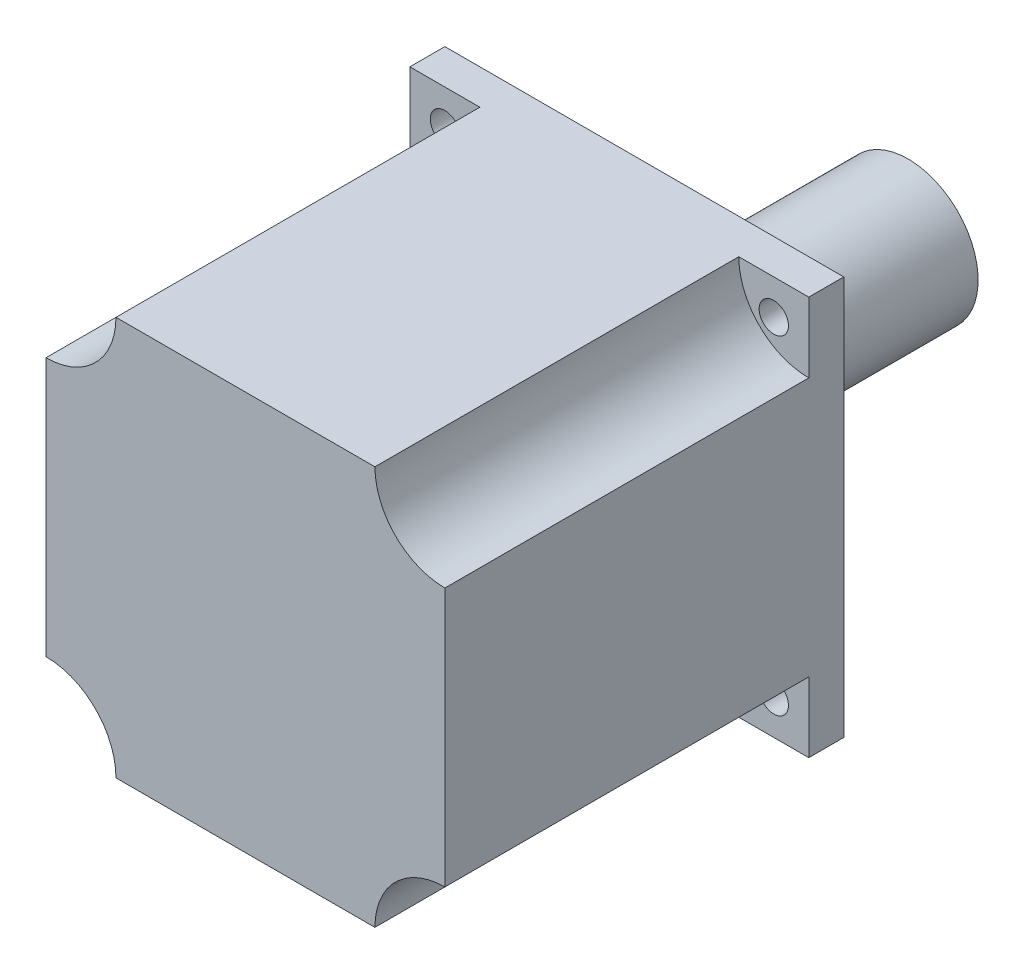
ISO-10303-21;
HEADER;
FILE_DESCRIPTION(('STEP AP214'),'2;1');
FILE_NAME('part.step','',(''),(''),'','','');
FILE_SCHEMA(('AUTOMOTIVE_DESIGN { 1 0 10303 214 1 1 1 1 }'));
ENDSEC;
DATA;
#1=APPLICATION_CONTEXT('core data for automotive mechanical design processes');
#2=APPLICATION_PROTOCOL_DEFINITION('international standard','automotive_design',2000,#1);
#3=PRODUCT_CONTEXT('',#1,'mechanical');
#4=PRODUCT('Part','Part','',(#3));
#5=PRODUCT_RELATED_PRODUCT_CATEGORY('part','',(#4));
#6=PRODUCT_DEFINITION_FORMATION('','',#4);
#7=PRODUCT_DEFINITION_CONTEXT('part definition',#1,'design');
#8=PRODUCT_DEFINITION('design','',#6,#7);
#9=PRODUCT_DEFINITION_SHAPE('','',#8);
#10=(LENGTH_UNIT() NAMED_UNIT(*) SI_UNIT(.MILLI.,.METRE.));
#11=(NAMED_UNIT(*) PLANE_ANGLE_UNIT() SI_UNIT($,.RADIAN.));
#12=(NAMED_UNIT(*) SI_UNIT($,.STERADIAN.) SOLID_ANGLE_UNIT());
#13=UNCERTAINTY_MEASURE_WITH_UNIT(LENGTH_MEASURE(1.E-05),#10,'distance_accuracy_value','');
#14=(GEOMETRIC_REPRESENTATION_CONTEXT(3) GLOBAL_UNCERTAINTY_ASSIGNED_CONTEXT((#13)) GLOBAL_UNIT_ASSIGNED_CONTEXT((#10,
#11,#12)) REPRESENTATION_CONTEXT('',''));
#15=CARTESIAN_POINT('',(0.,0.,0.));
#16=DIRECTION('',(0.,0.,1.));
#17=DIRECTION('',(1.,0.,0.));
#18=AXIS2_PLACEMENT_3D('',#15,#16,#17);
#19=CARTESIAN_POINT('',(28.5,-28.5,57.));
#20=DIRECTION('',(-1.,0.,0.));
#21=DIRECTION('',(0.,0.,1.));
#22=AXIS2_PLACEMENT_3D('',#19,#20,#21);
#23=PLANE('',#22);
#24=DIRECTION('',(0.,1.,0.));
#25=VECTOR('',#24,1.);
#26=CARTESIAN_POINT('',(28.5,-28.5,57.));
#27=LINE('',#26,#25);
#28=CARTESIAN_POINT('',(28.5,-18.5,57.));
#29=VERTEX_POINT('',#28);
#30=CARTESIAN_POINT('',(28.5,18.5,57.));
#31=VERTEX_POINT('',#30);
#32=EDGE_CURVE('E199',#29,#31,#27,.T.);
#33=ORIENTED_EDGE('',*,*,#32,.F.);
#34=DIRECTION('',(0.,0.,1.));
#35=VECTOR('',#34,1.);
#36=CARTESIAN_POINT('',(28.5,-18.5,5.));
#37=LINE('',#36,#35);
#38=CARTESIAN_POINT('',(28.5,-18.5,5.));
#39=VERTEX_POINT('',#38);
#40=EDGE_CURVE('E178',#29,#39,#37,.F.);
#41=ORIENTED_EDGE('',*,*,#40,.T.);
#42=DIRECTION('',(0.,1.,0.));
#43=VECTOR('',#42,1.);
#44=CARTESIAN_POINT('',(28.5,-28.5,5.));
#45=LINE('',#44,#43);
#46=CARTESIAN_POINT('',(28.5,-28.5,5.));
#47=VERTEX_POINT('',#46);
#48=EDGE_CURVE('E190',#47,#39,#45,.T.);
#49=ORIENTED_EDGE('',*,*,#48,.F.);
#50=DIRECTION('',(0.,0.,-1.));
#51=VECTOR('',#50,1.);
#52=CARTESIAN_POINT('',(28.5,-28.5,57.));
#53=LINE('',#52,#51);
#54=CARTESIAN_POINT('',(28.5,-28.5,0.));
#55=VERTEX_POINT('',#54);
#56=EDGE_CURVE('E214',#47,#55,#53,.T.);
#57=ORIENTED_EDGE('',*,*,#56,.T.);
#58=DIRECTION('',(0.,1.,0.));
#59=VECTOR('',#58,1.);
#60=CARTESIAN_POINT('',(28.5,-28.5,0.));
#61=LINE('',#60,#59);
#62=CARTESIAN_POINT('',(28.5,28.5,0.));
#63=VERTEX_POINT('',#62);
#64=EDGE_CURVE('E198',#55,#63,#61,.T.);
#65=ORIENTED_EDGE('',*,*,#64,.T.);
#66=DIRECTION('',(0.,0.,-1.));
#67=VECTOR('',#66,1.);
#68=CARTESIAN_POINT('',(28.5,28.5,57.));
#69=LINE('',#68,#67);
#70=CARTESIAN_POINT('',(28.5,28.5,5.));
#71=VERTEX_POINT('',#70);
#72=EDGE_CURVE('E237',#71,#63,#69,.T.);
#73=ORIENTED_EDGE('',*,*,#72,.F.);
#74=DIRECTION('',(0.,1.,0.));
#75=VECTOR('',#74,1.);
#76=CARTESIAN_POINT('',(28.5,-28.5,5.));
#77=LINE('',#76,#75);
#78=CARTESIAN_POINT('',(28.5,18.5,5.));
#79=VERTEX_POINT('',#78);
#80=EDGE_CURVE('E143',#79,#71,#77,.T.);
#81=ORIENTED_EDGE('',*,*,#80,.F.);
#82=DIRECTION('',(0.,0.,1.));
#83=VECTOR('',#82,1.);
#84=CARTESIAN_POINT('',(28.5,18.5,5.));
#85=LINE('',#84,#83);
#86=EDGE_CURVE('E152',#79,#31,#85,.T.);
#87=ORIENTED_EDGE('',*,*,#86,.T.);
#88=EDGE_LOOP('',(#33,#41,#49,#57,#65,#73,#81,#87));
#89=FACE_BOUND('',#88,.T.);
#90=ADVANCED_FACE('F49',(#89),#23,.F.);
#91=CARTESIAN_POINT('',(-28.5,28.5,57.));
#92=DIRECTION('',(0.,-1.,0.));
#93=DIRECTION('',(0.,0.,-1.));
#94=AXIS2_PLACEMENT_3D('',#91,#92,#93);
#95=PLANE('',#94);
#96=DIRECTION('',(-1.,0.,0.));
#97=VECTOR('',#96,1.);
#98=CARTESIAN_POINT('',(-28.5,28.5,5.));
#99=LINE('',#98,#97);
#100=CARTESIAN_POINT('',(-18.5,28.5,5.));
#101=VERTEX_POINT('',#100);
#102=CARTESIAN_POINT('',(-28.5,28.5,5.));
#103=VERTEX_POINT('',#102);
#104=EDGE_CURVE('E193',#101,#103,#99,.T.);
#105=ORIENTED_EDGE('',*,*,#104,.F.);
#106=DIRECTION('',(0.,0.,1.));
#107=VECTOR('',#106,1.);
#108=CARTESIAN_POINT('',(-18.5,28.5,5.));
#109=LINE('',#108,#107);
#110=CARTESIAN_POINT('',(-18.5,28.5,57.));
#111=VERTEX_POINT('',#110);
#112=EDGE_CURVE('E184',#101,#111,#109,.T.);
#113=ORIENTED_EDGE('',*,*,#112,.T.);
#114=DIRECTION('',(-1.,0.,0.));
#115=VECTOR('',#114,1.);
#116=CARTESIAN_POINT('',(-28.5,28.5,57.));
#117=LINE('',#116,#115);
#118=CARTESIAN_POINT('',(18.5,28.5,57.));
#119=VERTEX_POINT('',#118);
#120=EDGE_CURVE('E161',#119,#111,#117,.T.);
#121=ORIENTED_EDGE('',*,*,#120,.F.);
#122=DIRECTION('',(0.,0.,1.));
#123=VECTOR('',#122,1.);
#124=CARTESIAN_POINT('',(18.5,28.5,5.));
#125=LINE('',#124,#123);
#126=CARTESIAN_POINT('',(18.5,28.5,5.));
#127=VERTEX_POINT('',#126);
#128=EDGE_CURVE('E149',#119,#127,#125,.F.);
#129=ORIENTED_EDGE('',*,*,#128,.T.);
#130=DIRECTION('',(-1.,0.,0.));
#131=VECTOR('',#130,1.);
#132=CARTESIAN_POINT('',(-28.5,28.5,5.));
#133=LINE('',#132,#131);
#134=EDGE_CURVE('E11',#71,#127,#133,.T.);
#135=ORIENTED_EDGE('',*,*,#134,.F.);
#136=ORIENTED_EDGE('',*,*,#72,.T.);
#137=DIRECTION('',(-1.,0.,0.));
#138=VECTOR('',#137,1.);
#139=CARTESIAN_POINT('',(-28.5,28.5,0.));
#140=LINE('',#139,#138);
#141=CARTESIAN_POINT('',(-28.5,28.5,0.));
#142=VERTEX_POINT('',#141);
#143=EDGE_CURVE('E218',#63,#142,#140,.T.);
#144=ORIENTED_EDGE('',*,*,#143,.T.);
#145=DIRECTION('',(0.,0.,-1.));
#146=VECTOR('',#145,1.);
#147=CARTESIAN_POINT('',(-28.5,28.5,57.));
#148=LINE('',#147,#146);
#149=EDGE_CURVE('E234',#103,#142,#148,.T.);
#150=ORIENTED_EDGE('',*,*,#149,.F.);
#151=EDGE_LOOP('',(#105,#113,#121,#129,#135,#136,#144,#150));
#152=FACE_BOUND('',#151,.T.);
#153=ADVANCED_FACE('F158',(#152),#95,.F.);
#154=CARTESIAN_POINT('',(-28.5,-28.5,57.));
#155=DIRECTION('',(1.,0.,0.));
#156=DIRECTION('',(0.,0.,-1.));
#157=AXIS2_PLACEMENT_3D('',#154,#155,#156);
#158=PLANE('',#157);
#159=DIRECTION('',(0.,-1.,0.));
#160=VECTOR('',#159,1.);
#161=CARTESIAN_POINT('',(-28.5,-28.5,57.));
#162=LINE('',#161,#160);
#163=CARTESIAN_POINT('',(-28.5,18.5,57.));
#164=VERTEX_POINT('',#163);
#165=CARTESIAN_POINT('',(-28.5,-18.5,57.));
#166=VERTEX_POINT('',#165);
#167=EDGE_CURVE('E206',#164,#166,#162,.T.);
#168=ORIENTED_EDGE('',*,*,#167,.F.);
#169=DIRECTION('',(0.,0.,1.));
#170=VECTOR('',#169,1.);
#171=CARTESIAN_POINT('',(-28.5,18.5,5.));
#172=LINE('',#171,#170);
#173=CARTESIAN_POINT('',(-28.5,18.5,5.));
#174=VERTEX_POINT('',#173);
#175=EDGE_CURVE('E72',#164,#174,#172,.F.);
#176=ORIENTED_EDGE('',*,*,#175,.T.);
#177=DIRECTION('',(0.,-1.,0.));
#178=VECTOR('',#177,1.);
#179=CARTESIAN_POINT('',(-28.5,-28.5,5.));
#180=LINE('',#179,#178);
#181=EDGE_CURVE('E57',#103,#174,#180,.T.);
#182=ORIENTED_EDGE('',*,*,#181,.F.);
#183=ORIENTED_EDGE('',*,*,#149,.T.);
#184=DIRECTION('',(0.,-1.,0.));
#185=VECTOR('',#184,1.);
#186=CARTESIAN_POINT('',(-28.5,-28.5,0.));
#187=LINE('',#186,#185);
#188=CARTESIAN_POINT('',(-28.5,-28.5,0.));
#189=VERTEX_POINT('',#188);
#190=EDGE_CURVE('E222',#142,#189,#187,.T.);
#191=ORIENTED_EDGE('',*,*,#190,.T.);
#192=DIRECTION('',(0.,0.,-1.));
#193=VECTOR('',#192,1.);
#194=CARTESIAN_POINT('',(-28.5,-28.5,57.));
#195=LINE('',#194,#193);
#196=CARTESIAN_POINT('',(-28.5,-28.5,5.));
#197=VERTEX_POINT('',#196);
#198=EDGE_CURVE('E231',#197,#189,#195,.T.);
#199=ORIENTED_EDGE('',*,*,#198,.F.);
#200=DIRECTION('',(0.,-1.,0.));
#201=VECTOR('',#200,1.);
#202=CARTESIAN_POINT('',(-28.5,-28.5,5.));
#203=LINE('',#202,#201);
#204=CARTESIAN_POINT('',(-28.5,-18.5,5.));
#205=VERTEX_POINT('',#204);
#206=EDGE_CURVE('E187',#205,#197,#203,.T.);
#207=ORIENTED_EDGE('',*,*,#206,.F.);
#208=DIRECTION('',(0.,0.,1.));
#209=VECTOR('',#208,1.);
#210=CARTESIAN_POINT('',(-28.5,-18.5,5.));
#211=LINE('',#210,#209);
#212=EDGE_CURVE('E170',#205,#166,#211,.T.);
#213=ORIENTED_EDGE('',*,*,#212,.T.);
#214=EDGE_LOOP('',(#168,#176,#182,#183,#191,#199,#207,#213));
#215=FACE_BOUND('',#214,.T.);
#216=ADVANCED_FACE('F261',(#215),#158,.F.);
#217=CARTESIAN_POINT('',(-28.5,-28.5,57.));
#218=DIRECTION('',(0.,1.,0.));
#219=DIRECTION('',(0.,0.,1.));
#220=AXIS2_PLACEMENT_3D('',#217,#218,#219);
#221=PLANE('',#220);
#222=DIRECTION('',(1.,0.,0.));
#223=VECTOR('',#222,1.);
#224=CARTESIAN_POINT('',(-28.5,-28.5,5.));
#225=LINE('',#224,#223);
#226=CARTESIAN_POINT('',(18.5,-28.5,5.));
#227=VERTEX_POINT('',#226);
#228=EDGE_CURVE('E246',#227,#47,#225,.T.);
#229=ORIENTED_EDGE('',*,*,#228,.F.);
#230=DIRECTION('',(0.,0.,1.));
#231=VECTOR('',#230,1.);
#232=CARTESIAN_POINT('',(18.5,-28.5,5.));
#233=LINE('',#232,#231);
#234=CARTESIAN_POINT('',(18.5,-28.5,57.));
#235=VERTEX_POINT('',#234);
#236=EDGE_CURVE('E174',#227,#235,#233,.T.);
#237=ORIENTED_EDGE('',*,*,#236,.T.);
#238=DIRECTION('',(1.,0.,0.));
#239=VECTOR('',#238,1.);
#240=CARTESIAN_POINT('',(-28.5,-28.5,57.));
#241=LINE('',#240,#239);
#242=CARTESIAN_POINT('',(-18.5,-28.5,57.));
#243=VERTEX_POINT('',#242);
#244=EDGE_CURVE('E210',#243,#235,#241,.T.);
#245=ORIENTED_EDGE('',*,*,#244,.F.);
#246=DIRECTION('',(0.,0.,1.));
#247=VECTOR('',#246,1.);
#248=CARTESIAN_POINT('',(-18.5,-28.5,5.));
#249=LINE('',#248,#247);
#250=CARTESIAN_POINT('',(-18.5,-28.5,5.));
#251=VERTEX_POINT('',#250);
#252=EDGE_CURVE('E64',#243,#251,#249,.F.);
#253=ORIENTED_EDGE('',*,*,#252,.T.);
#254=DIRECTION('',(1.,0.,0.));
#255=VECTOR('',#254,1.);
#256=CARTESIAN_POINT('',(-28.5,-28.5,5.));
#257=LINE('',#256,#255);
#258=EDGE_CURVE('E243',#197,#251,#257,.T.);
#259=ORIENTED_EDGE('',*,*,#258,.F.);
#260=ORIENTED_EDGE('',*,*,#198,.T.);
#261=DIRECTION('',(1.,0.,0.));
#262=VECTOR('',#261,1.);
#263=CARTESIAN_POINT('',(-28.5,-28.5,0.));
#264=LINE('',#263,#262);
#265=EDGE_CURVE('E203',#189,#55,#264,.T.);
#266=ORIENTED_EDGE('',*,*,#265,.T.);
#267=ORIENTED_EDGE('',*,*,#56,.F.);
#268=EDGE_LOOP('',(#229,#237,#245,#253,#259,#260,#266,#267));
#269=FACE_BOUND('',#268,.T.);
#270=ADVANCED_FACE('F277',(#269),#221,.F.);
#271=CARTESIAN_POINT('',(0.,0.,57.));
#272=DIRECTION('',(0.,0.,-1.));
#273=DIRECTION('',(-1.,0.,0.));
#274=AXIS2_PLACEMENT_3D('',#271,#272,#273);
#275=PLANE('',#274);
#276=ORIENTED_EDGE('',*,*,#120,.T.);
#277=CARTESIAN_POINT('',(-28.5,28.5,57.));
#278=DIRECTION('',(0.,0.,-1.));
#279=DIRECTION('',(-1.,0.,0.));
#280=AXIS2_PLACEMENT_3D('',#277,#278,#279);
#281=CIRCLE('',#280,10.);
#282=EDGE_CURVE('E240',#111,#164,#281,.T.);
#283=ORIENTED_EDGE('',*,*,#282,.T.);
#284=ORIENTED_EDGE('',*,*,#167,.T.);
#285=CARTESIAN_POINT('',(-28.5,-28.5,57.));
#286=DIRECTION('',(0.,0.,1.));
#287=DIRECTION('',(1.,0.,0.));
#288=AXIS2_PLACEMENT_3D('',#285,#286,#287);
#289=CIRCLE('',#288,10.);
#290=EDGE_CURVE('E265',#243,#166,#289,.T.);
#291=ORIENTED_EDGE('',*,*,#290,.F.);
#292=ORIENTED_EDGE('',*,*,#244,.T.);
#293=CARTESIAN_POINT('',(28.5,-28.5,57.));
#294=DIRECTION('',(0.,0.,1.));
#295=DIRECTION('',(1.,0.,0.));
#296=AXIS2_PLACEMENT_3D('',#293,#294,#295);
#297=CIRCLE('',#296,10.);
#298=EDGE_CURVE('E285',#29,#235,#297,.T.);
#299=ORIENTED_EDGE('',*,*,#298,.F.);
#300=ORIENTED_EDGE('',*,*,#32,.T.);
#301=CARTESIAN_POINT('',(28.5,28.5,57.));
#302=DIRECTION('',(0.,0.,1.));
#303=DIRECTION('',(1.,0.,0.));
#304=AXIS2_PLACEMENT_3D('',#301,#302,#303);
#305=CIRCLE('',#304,10.);
#306=EDGE_CURVE('E154',#119,#31,#305,.T.);
#307=ORIENTED_EDGE('',*,*,#306,.F.);
#308=EDGE_LOOP('',(#276,#283,#284,#291,#292,#299,#300,#307));
#309=FACE_BOUND('',#308,.T.);
#310=ADVANCED_FACE('F264',(#309),#275,.F.);
#311=CARTESIAN_POINT('',(0.,0.,0.));
#312=DIRECTION('',(0.,0.,-1.));
#313=DIRECTION('',(-1.,0.,0.));
#314=AXIS2_PLACEMENT_3D('',#311,#312,#313);
#315=PLANE('',#314);
#316=CARTESIAN_POINT('',(0.,0.,0.));
#317=DIRECTION('',(0.,0.,-1.));
#318=DIRECTION('',(-1.,0.,0.));
#319=AXIS2_PLACEMENT_3D('',#316,#317,#318);
#320=CIRCLE('',#319,5.);
#321=CARTESIAN_POINT('',(-5.,0.,0.));
#322=VERTEX_POINT('',#321);
#323=EDGE_CURVE('E353',#322,#322,#320,.T.);
#324=ORIENTED_EDGE('',*,*,#323,.F.);
#325=EDGE_LOOP('',(#324));
#326=FACE_BOUND('',#325,.T.);
#327=CARTESIAN_POINT('',(23.5000000000393,23.5000000000395,0.));
#328=DIRECTION('',(0.,0.,1.));
#329=DIRECTION('',(1.,0.,0.));
#330=AXIS2_PLACEMENT_3D('',#327,#328,#329);
#331=CIRCLE('',#330,2.09413920896615);
#332=CARTESIAN_POINT('',(25.5941392090054,23.5000000000395,0.));
#333=VERTEX_POINT('',#332);
#334=EDGE_CURVE('E344',#333,#333,#331,.T.);
#335=ORIENTED_EDGE('',*,*,#334,.T.);
#336=EDGE_LOOP('',(#335));
#337=FACE_BOUND('',#336,.T.);
#338=CARTESIAN_POINT('',(-23.5000000000001,23.5000000000394,0.));
#339=DIRECTION('',(0.,0.,1.));
#340=DIRECTION('',(1.,0.,0.));
#341=AXIS2_PLACEMENT_3D('',#338,#339,#340);
#342=CIRCLE('',#341,2.09413920896615);
#343=CARTESIAN_POINT('',(-21.4058607910339,23.5000000000394,0.));
#344=VERTEX_POINT('',#343);
#345=EDGE_CURVE('E373',#344,#344,#342,.T.);
#346=ORIENTED_EDGE('',*,*,#345,.T.);
#347=EDGE_LOOP('',(#346));
#348=FACE_BOUND('',#347,.T.);
#349=CARTESIAN_POINT('',(-23.5,-23.5,0.));
#350=DIRECTION('',(0.,0.,1.));
#351=DIRECTION('',(1.,0.,0.));
#352=AXIS2_PLACEMENT_3D('',#349,#350,#351);
#353=CIRCLE('',#352,2.09413920896615);
#354=CARTESIAN_POINT('',(-21.4058607910338,-23.5,0.));
#355=VERTEX_POINT('',#354);
#356=EDGE_CURVE('E362',#355,#355,#353,.T.);
#357=ORIENTED_EDGE('',*,*,#356,.T.);
#358=EDGE_LOOP('',(#357));
#359=FACE_BOUND('',#358,.T.);
#360=CARTESIAN_POINT('',(23.5000000000394,-23.4999999999999,0.));
#361=DIRECTION('',(0.,0.,1.));
#362=DIRECTION('',(1.,0.,0.));
#363=AXIS2_PLACEMENT_3D('',#360,#361,#362);
#364=CIRCLE('',#363,2.09413920896615);
#365=CARTESIAN_POINT('',(25.5941392090055,-23.4999999999999,0.));
#366=VERTEX_POINT('',#365);
#367=EDGE_CURVE('E290',#366,#366,#364,.T.);
#368=ORIENTED_EDGE('',*,*,#367,.T.);
#369=EDGE_LOOP('',(#368));
#370=FACE_BOUND('',#369,.T.);
#371=ORIENTED_EDGE('',*,*,#64,.F.);
#372=ORIENTED_EDGE('',*,*,#265,.F.);
#373=ORIENTED_EDGE('',*,*,#190,.F.);
#374=ORIENTED_EDGE('',*,*,#143,.F.);
#375=EDGE_LOOP('',(#371,#372,#373,#374));
#376=FACE_BOUND('',#375,.T.);
#377=ADVANCED_FACE('F273',(#326,#337,#348,#359,#370,#376),#315,.T.);
#378=CARTESIAN_POINT('',(28.5,28.5,5.));
#379=DIRECTION('',(0.,0.,1.));
#380=DIRECTION('',(1.,0.,0.));
#381=AXIS2_PLACEMENT_3D('',#378,#379,#380);
#382=PLANE('',#381);
#383=CARTESIAN_POINT('',(23.5000000000393,23.5000000000395,5.));
#384=DIRECTION('',(0.,0.,1.));
#385=DIRECTION('',(1.,0.,0.));
#386=AXIS2_PLACEMENT_3D('',#383,#384,#385);
#387=CIRCLE('',#386,2.09413920896615);
#388=CARTESIAN_POINT('',(25.5941392090054,23.5000000000395,5.));
#389=VERTEX_POINT('',#388);
#390=EDGE_CURVE('E341',#389,#389,#387,.T.);
#391=ORIENTED_EDGE('',*,*,#390,.F.);
#392=EDGE_LOOP('',(#391));
#393=FACE_BOUND('',#392,.T.);
#394=ORIENTED_EDGE('',*,*,#80,.T.);
#395=ORIENTED_EDGE('',*,*,#134,.T.);
#396=CARTESIAN_POINT('',(28.5,28.5,5.));
#397=DIRECTION('',(0.,0.,1.));
#398=DIRECTION('',(1.,0.,0.));
#399=AXIS2_PLACEMENT_3D('',#396,#397,#398);
#400=CIRCLE('',#399,10.);
#401=EDGE_CURVE('E141',#127,#79,#400,.T.);
#402=ORIENTED_EDGE('',*,*,#401,.T.);
#403=EDGE_LOOP('',(#394,#395,#402));
#404=FACE_BOUND('',#403,.T.);
#405=ADVANCED_FACE('F140',(#393,#404),#382,.T.);
#406=CARTESIAN_POINT('',(28.5,28.5,5.));
#407=DIRECTION('',(0.,0.,1.));
#408=DIRECTION('',(1.,0.,0.));
#409=AXIS2_PLACEMENT_3D('',#406,#407,#408);
#410=CYLINDRICAL_SURFACE('',#409,10.);
#411=ORIENTED_EDGE('',*,*,#401,.F.);
#412=ORIENTED_EDGE('',*,*,#128,.F.);
#413=ORIENTED_EDGE('',*,*,#306,.T.);
#414=ORIENTED_EDGE('',*,*,#86,.F.);
#415=EDGE_LOOP('',(#411,#412,#413,#414));
#416=FACE_BOUND('',#415,.T.);
#417=ADVANCED_FACE('F148',(#416),#410,.F.);
#418=CARTESIAN_POINT('',(-28.5,-28.5,5.));
#419=DIRECTION('',(0.,0.,1.));
#420=DIRECTION('',(1.,0.,0.));
#421=AXIS2_PLACEMENT_3D('',#418,#419,#420);
#422=PLANE('',#421);
#423=CARTESIAN_POINT('',(-23.5,-23.5,5.));
#424=DIRECTION('',(0.,0.,1.));
#425=DIRECTION('',(1.,0.,0.));
#426=AXIS2_PLACEMENT_3D('',#423,#424,#425);
#427=CIRCLE('',#426,2.09413920896615);
#428=CARTESIAN_POINT('',(-21.4058607910338,-23.5,5.));
#429=VERTEX_POINT('',#428);
#430=EDGE_CURVE('E367',#429,#429,#427,.T.);
#431=ORIENTED_EDGE('',*,*,#430,.F.);
#432=EDGE_LOOP('',(#431));
#433=FACE_BOUND('',#432,.T.);
#434=ORIENTED_EDGE('',*,*,#206,.T.);
#435=ORIENTED_EDGE('',*,*,#258,.T.);
#436=CARTESIAN_POINT('',(-28.5,-28.5,5.));
#437=DIRECTION('',(0.,0.,1.));
#438=DIRECTION('',(1.,0.,0.));
#439=AXIS2_PLACEMENT_3D('',#436,#437,#438);
#440=CIRCLE('',#439,10.);
#441=EDGE_CURVE('E282',#251,#205,#440,.T.);
#442=ORIENTED_EDGE('',*,*,#441,.T.);
#443=EDGE_LOOP('',(#434,#435,#442));
#444=FACE_BOUND('',#443,.T.);
#445=ADVANCED_FACE('F281',(#433,#444),#422,.T.);
#446=CARTESIAN_POINT('',(-28.5,-28.5,5.));
#447=DIRECTION('',(0.,0.,1.));
#448=DIRECTION('',(1.,0.,0.));
#449=AXIS2_PLACEMENT_3D('',#446,#447,#448);
#450=CYLINDRICAL_SURFACE('',#449,10.);
#451=ORIENTED_EDGE('',*,*,#441,.F.);
#452=ORIENTED_EDGE('',*,*,#252,.F.);
#453=ORIENTED_EDGE('',*,*,#290,.T.);
#454=ORIENTED_EDGE('',*,*,#212,.F.);
#455=EDGE_LOOP('',(#451,#452,#453,#454));
#456=FACE_BOUND('',#455,.T.);
#457=ADVANCED_FACE('F283',(#456),#450,.F.);
#458=CARTESIAN_POINT('',(28.5,-28.5,5.));
#459=DIRECTION('',(0.,0.,1.));
#460=DIRECTION('',(1.,0.,0.));
#461=AXIS2_PLACEMENT_3D('',#458,#459,#460);
#462=PLANE('',#461);
#463=CARTESIAN_POINT('',(23.5000000000394,-23.4999999999999,5.));
#464=DIRECTION('',(0.,0.,1.));
#465=DIRECTION('',(1.,0.,0.));
#466=AXIS2_PLACEMENT_3D('',#463,#464,#465);
#467=CIRCLE('',#466,2.09413920896615);
#468=CARTESIAN_POINT('',(25.5941392090055,-23.4999999999999,5.));
#469=VERTEX_POINT('',#468);
#470=EDGE_CURVE('E293',#469,#469,#467,.T.);
#471=ORIENTED_EDGE('',*,*,#470,.F.);
#472=EDGE_LOOP('',(#471));
#473=FACE_BOUND('',#472,.T.);
#474=ORIENTED_EDGE('',*,*,#48,.T.);
#475=CARTESIAN_POINT('',(28.5,-28.5,5.));
#476=DIRECTION('',(0.,0.,1.));
#477=DIRECTION('',(1.,0.,0.));
#478=AXIS2_PLACEMENT_3D('',#475,#476,#477);
#479=CIRCLE('',#478,10.);
#480=EDGE_CURVE('E258',#39,#227,#479,.T.);
#481=ORIENTED_EDGE('',*,*,#480,.T.);
#482=ORIENTED_EDGE('',*,*,#228,.T.);
#483=EDGE_LOOP('',(#474,#481,#482));
#484=FACE_BOUND('',#483,.T.);
#485=ADVANCED_FACE('F300',(#473,#484),#462,.T.);
#486=CARTESIAN_POINT('',(28.5,-28.5,5.));
#487=DIRECTION('',(0.,0.,1.));
#488=DIRECTION('',(1.,0.,0.));
#489=AXIS2_PLACEMENT_3D('',#486,#487,#488);
#490=CYLINDRICAL_SURFACE('',#489,10.);
#491=ORIENTED_EDGE('',*,*,#298,.T.);
#492=ORIENTED_EDGE('',*,*,#236,.F.);
#493=ORIENTED_EDGE('',*,*,#480,.F.);
#494=ORIENTED_EDGE('',*,*,#40,.F.);
#495=EDGE_LOOP('',(#491,#492,#493,#494));
#496=FACE_BOUND('',#495,.T.);
#497=ADVANCED_FACE('F306',(#496),#490,.F.);
#498=CARTESIAN_POINT('',(-28.5,28.5,5.));
#499=DIRECTION('',(0.,0.,1.));
#500=DIRECTION('',(1.,0.,0.));
#501=AXIS2_PLACEMENT_3D('',#498,#499,#500);
#502=PLANE('',#501);
#503=CARTESIAN_POINT('',(-23.5000000000001,23.5000000000394,5.));
#504=DIRECTION('',(0.,0.,1.));
#505=DIRECTION('',(1.,0.,0.));
#506=AXIS2_PLACEMENT_3D('',#503,#504,#505);
#507=CIRCLE('',#506,2.09413920896615);
#508=CARTESIAN_POINT('',(-21.4058607910339,23.5000000000394,5.));
#509=VERTEX_POINT('',#508);
#510=EDGE_CURVE('E350',#509,#509,#507,.T.);
#511=ORIENTED_EDGE('',*,*,#510,.F.);
#512=EDGE_LOOP('',(#511));
#513=FACE_BOUND('',#512,.T.);
#514=ORIENTED_EDGE('',*,*,#104,.T.);
#515=ORIENTED_EDGE('',*,*,#181,.T.);
#516=CARTESIAN_POINT('',(-28.5,28.5,5.));
#517=DIRECTION('',(0.,0.,1.));
#518=DIRECTION('',(1.,0.,0.));
#519=AXIS2_PLACEMENT_3D('',#516,#517,#518);
#520=CIRCLE('',#519,10.);
#521=EDGE_CURVE('E253',#174,#101,#520,.T.);
#522=ORIENTED_EDGE('',*,*,#521,.T.);
#523=EDGE_LOOP('',(#514,#515,#522));
#524=FACE_BOUND('',#523,.T.);
#525=ADVANCED_FACE('F252',(#513,#524),#502,.T.);
#526=CARTESIAN_POINT('',(-28.5,28.5,5.));
#527=DIRECTION('',(0.,0.,1.));
#528=DIRECTION('',(1.,0.,0.));
#529=AXIS2_PLACEMENT_3D('',#526,#527,#528);
#530=CYLINDRICAL_SURFACE('',#529,10.);
#531=ORIENTED_EDGE('',*,*,#521,.F.);
#532=ORIENTED_EDGE('',*,*,#175,.F.);
#533=ORIENTED_EDGE('',*,*,#282,.F.);
#534=ORIENTED_EDGE('',*,*,#112,.F.);
#535=EDGE_LOOP('',(#531,#532,#533,#534));
#536=FACE_BOUND('',#535,.T.);
#537=ADVANCED_FACE('F256',(#536),#530,.F.);
#538=CARTESIAN_POINT('',(-23.5000000000001,23.5000000000394,0.));
#539=DIRECTION('',(0.,0.,1.));
#540=DIRECTION('',(1.,0.,0.));
#541=AXIS2_PLACEMENT_3D('',#538,#539,#540);
#542=CYLINDRICAL_SURFACE('',#541,2.09413920896615);
#543=ORIENTED_EDGE('',*,*,#345,.F.);
#544=EDGE_LOOP('',(#543));
#545=FACE_BOUND('',#544,.T.);
#546=ORIENTED_EDGE('',*,*,#510,.T.);
#547=EDGE_LOOP('',(#546));
#548=FACE_BOUND('',#547,.T.);
#549=ADVANCED_FACE('F383',(#545,#548),#542,.F.);
#550=CARTESIAN_POINT('',(23.5000000000394,-23.4999999999999,0.));
#551=DIRECTION('',(0.,0.,1.));
#552=DIRECTION('',(1.,0.,0.));
#553=AXIS2_PLACEMENT_3D('',#550,#551,#552);
#554=CYLINDRICAL_SURFACE('',#553,2.09413920896615);
#555=ORIENTED_EDGE('',*,*,#367,.F.);
#556=EDGE_LOOP('',(#555));
#557=FACE_BOUND('',#556,.T.);
#558=ORIENTED_EDGE('',*,*,#470,.T.);
#559=EDGE_LOOP('',(#558));
#560=FACE_BOUND('',#559,.T.);
#561=ADVANCED_FACE('F385',(#557,#560),#554,.F.);
#562=CARTESIAN_POINT('',(-23.5,-23.5,0.));
#563=DIRECTION('',(0.,0.,1.));
#564=DIRECTION('',(1.,0.,0.));
#565=AXIS2_PLACEMENT_3D('',#562,#563,#564);
#566=CYLINDRICAL_SURFACE('',#565,2.09413920896615);
#567=ORIENTED_EDGE('',*,*,#356,.F.);
#568=EDGE_LOOP('',(#567));
#569=FACE_BOUND('',#568,.T.);
#570=ORIENTED_EDGE('',*,*,#430,.T.);
#571=EDGE_LOOP('',(#570));
#572=FACE_BOUND('',#571,.T.);
#573=ADVANCED_FACE('F392',(#569,#572),#566,.F.);
#574=CARTESIAN_POINT('',(23.5000000000393,23.5000000000395,0.));
#575=DIRECTION('',(0.,0.,1.));
#576=DIRECTION('',(1.,0.,0.));
#577=AXIS2_PLACEMENT_3D('',#574,#575,#576);
#578=CYLINDRICAL_SURFACE('',#577,2.09413920896615);
#579=ORIENTED_EDGE('',*,*,#334,.F.);
#580=EDGE_LOOP('',(#579));
#581=FACE_BOUND('',#580,.T.);
#582=ORIENTED_EDGE('',*,*,#390,.T.);
#583=EDGE_LOOP('',(#582));
#584=FACE_BOUND('',#583,.T.);
#585=ADVANCED_FACE('F400',(#581,#584),#578,.F.);
#586=CARTESIAN_POINT('',(0.,0.,-11.7));
#587=DIRECTION('',(0.,0.,1.));
#588=DIRECTION('',(1.,0.,0.));
#589=AXIS2_PLACEMENT_3D('',#586,#587,#588);
#590=CYLINDRICAL_SURFACE('',#589,5.);
#591=CARTESIAN_POINT('',(0.,0.,-11.7));
#592=DIRECTION('',(0.,0.,-1.));
#593=DIRECTION('',(-1.,0.,0.));
#594=AXIS2_PLACEMENT_3D('',#591,#592,#593);
#595=CIRCLE('',#594,5.);
#596=CARTESIAN_POINT('',(-5.,0.,-11.7));
#597=VERTEX_POINT('',#596);
#598=EDGE_CURVE('E345',#597,#597,#595,.T.);
#599=ORIENTED_EDGE('',*,*,#598,.F.);
#600=EDGE_LOOP('',(#599));
#601=FACE_BOUND('',#600,.T.);
#602=ORIENTED_EDGE('',*,*,#323,.T.);
#603=EDGE_LOOP('',(#602));
#604=FACE_BOUND('',#603,.T.);
#605=ADVANCED_FACE('F402',(#601,#604),#590,.T.);
#606=CARTESIAN_POINT('',(0.,0.,-37.7));
#607=DIRECTION('',(0.,0.,1.));
#608=DIRECTION('',(1.,0.,0.));
#609=AXIS2_PLACEMENT_3D('',#606,#607,#608);
#610=CYLINDRICAL_SURFACE('',#609,10.);
#611=CARTESIAN_POINT('',(0.,0.,-37.7));
#612=DIRECTION('',(0.,0.,-1.));
#613=DIRECTION('',(-1.,0.,0.));
#614=AXIS2_PLACEMENT_3D('',#611,#612,#613);
#615=CIRCLE('',#614,10.);
#616=CARTESIAN_POINT('',(-10.,0.,-37.7));
#617=VERTEX_POINT('',#616);
#618=EDGE_CURVE('E598',#617,#617,#615,.T.);
#619=ORIENTED_EDGE('',*,*,#618,.F.);
#620=EDGE_LOOP('',(#619));
#621=FACE_BOUND('',#620,.T.);
#622=CARTESIAN_POINT('',(0.,0.,-11.7));
#623=DIRECTION('',(0.,0.,-1.));
#624=DIRECTION('',(-1.,0.,0.));
#625=AXIS2_PLACEMENT_3D('',#622,#623,#624);
#626=CIRCLE('',#625,10.);
#627=CARTESIAN_POINT('',(-10.,0.,-11.7));
#628=VERTEX_POINT('',#627);
#629=EDGE_CURVE('E595',#628,#628,#626,.T.);
#630=ORIENTED_EDGE('',*,*,#629,.T.);
#631=EDGE_LOOP('',(#630));
#632=FACE_BOUND('',#631,.T.);
#633=ADVANCED_FACE('F480',(#621,#632),#610,.T.);
#634=CARTESIAN_POINT('',(0.,0.,-37.7));
#635=DIRECTION('',(0.,0.,-1.));
#636=DIRECTION('',(-1.,0.,0.));
#637=AXIS2_PLACEMENT_3D('',#634,#635,#636);
#638=PLANE('',#637);
#639=ORIENTED_EDGE('',*,*,#618,.T.);
#640=EDGE_LOOP('',(#639));
#641=FACE_BOUND('',#640,.T.);
#642=ADVANCED_FACE('F488',(#641),#638,.T.);
#643=CARTESIAN_POINT('',(0.,0.,-11.7));
#644=DIRECTION('',(0.,0.,-1.));
#645=DIRECTION('',(-1.,0.,0.));
#646=AXIS2_PLACEMENT_3D('',#643,#644,#645);
#647=PLANE('',#646);
#648=ORIENTED_EDGE('',*,*,#598,.T.);
#649=EDGE_LOOP('',(#648));
#650=FACE_BOUND('',#649,.T.);
#651=ORIENTED_EDGE('',*,*,#629,.F.);
#652=EDGE_LOOP('',(#651));
#653=FACE_BOUND('',#652,.T.);
#654=ADVANCED_FACE('F497',(#650,#653),#647,.F.);
#655=CLOSED_SHELL('',(#90,#153,#216,#270,#310,#377,#405,#417,#445,#457,#485,#497,#525,#537,#549,
#561,#573,#585,#605,#633,#642,#654));
#656=MANIFOLD_SOLID_BREP('B2',#655);
#657=ADVANCED_BREP_SHAPE_REPRESENTATION('',(#18,#656),#14);
#658=SHAPE_DEFINITION_REPRESENTATION(#9,#657);
ENDSEC;
END-ISO-10303-21;
